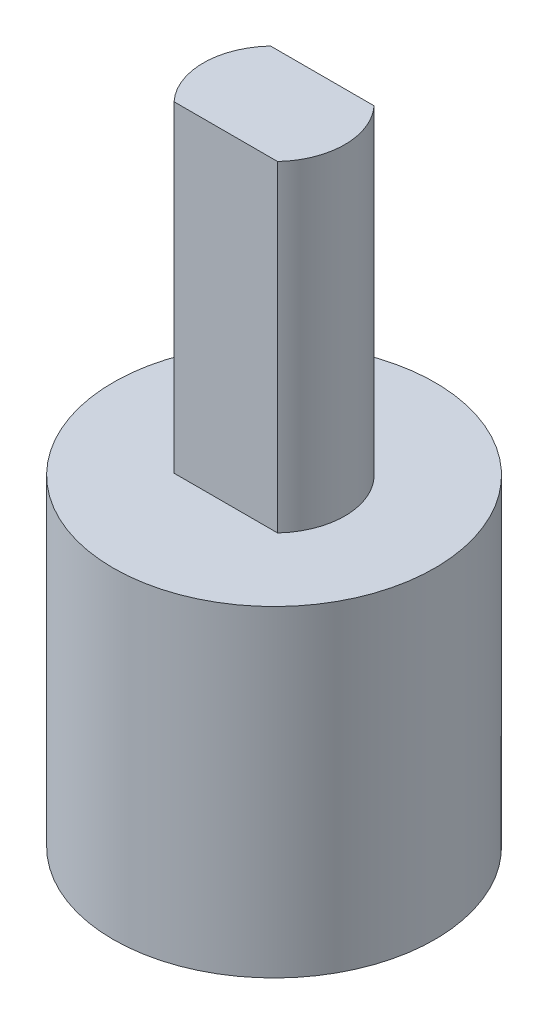
ISO-10303-21;
HEADER;
FILE_DESCRIPTION(('STEP AP214'),'2;1');
FILE_NAME('part.step','',(''),(''),'','','');
FILE_SCHEMA(('AUTOMOTIVE_DESIGN { 1 0 10303 214 1 1 1 1 }'));
ENDSEC;
DATA;
#1=APPLICATION_CONTEXT('core data for automotive mechanical design processes');
#2=APPLICATION_PROTOCOL_DEFINITION('international standard','automotive_design',2000,#1);
#3=PRODUCT_CONTEXT('',#1,'mechanical');
#4=PRODUCT('Part','Part','',(#3));
#5=PRODUCT_RELATED_PRODUCT_CATEGORY('part','',(#4));
#6=PRODUCT_DEFINITION_FORMATION('','',#4);
#7=PRODUCT_DEFINITION_CONTEXT('part definition',#1,'design');
#8=PRODUCT_DEFINITION('design','',#6,#7);
#9=PRODUCT_DEFINITION_SHAPE('','',#8);
#10=(LENGTH_UNIT() NAMED_UNIT(*) SI_UNIT(.MILLI.,.METRE.));
#11=(NAMED_UNIT(*) PLANE_ANGLE_UNIT() SI_UNIT($,.RADIAN.));
#12=(NAMED_UNIT(*) SI_UNIT($,.STERADIAN.) SOLID_ANGLE_UNIT());
#13=UNCERTAINTY_MEASURE_WITH_UNIT(LENGTH_MEASURE(1.E-05),#10,'distance_accuracy_value','');
#14=(GEOMETRIC_REPRESENTATION_CONTEXT(3) GLOBAL_UNCERTAINTY_ASSIGNED_CONTEXT((#13)) GLOBAL_UNIT_ASSIGNED_CONTEXT((#10,
#11,#12)) REPRESENTATION_CONTEXT('',''));
#15=CARTESIAN_POINT('',(0.,0.,0.));
#16=DIRECTION('',(0.,0.,1.));
#17=DIRECTION('',(1.,0.,0.));
#18=AXIS2_PLACEMENT_3D('',#15,#16,#17);
#19=CARTESIAN_POINT('',(0.,0.,0.));
#20=DIRECTION('',(0.,1.,0.));
#21=DIRECTION('',(0.,0.,1.));
#22=AXIS2_PLACEMENT_3D('',#19,#20,#21);
#23=PLANE('',#22);
#24=CARTESIAN_POINT('',(0.,0.,0.));
#25=DIRECTION('',(0.,1.,0.));
#26=DIRECTION('',(0.,0.,1.));
#27=AXIS2_PLACEMENT_3D('',#24,#25,#26);
#28=CIRCLE('',#27,5.);
#29=CARTESIAN_POINT('',(0.,0.,5.));
#30=VERTEX_POINT('',#29);
#31=EDGE_CURVE('E11',#30,#30,#28,.T.);
#32=ORIENTED_EDGE('',*,*,#31,.F.);
#33=EDGE_LOOP('',(#32));
#34=FACE_BOUND('',#33,.T.);
#35=CARTESIAN_POINT('',(0.,0.,0.));
#36=DIRECTION('',(0.,1.,0.));
#37=DIRECTION('',(0.,0.,1.));
#38=AXIS2_PLACEMENT_3D('',#35,#36,#37);
#39=CIRCLE('',#38,2.5);
#40=CARTESIAN_POINT('',(-2.,0.,-1.5));
#41=VERTEX_POINT('',#40);
#42=CARTESIAN_POINT('',(2.,0.,-1.5));
#43=VERTEX_POINT('',#42);
#44=EDGE_CURVE('E113',#41,#43,#39,.T.);
#45=ORIENTED_EDGE('',*,*,#44,.T.);
#46=DIRECTION('',(-1.,0.,0.));
#47=VECTOR('',#46,1.);
#48=CARTESIAN_POINT('',(-2.,0.,-1.5));
#49=LINE('',#48,#47);
#50=EDGE_CURVE('E123',#43,#41,#49,.T.);
#51=ORIENTED_EDGE('',*,*,#50,.T.);
#52=EDGE_LOOP('',(#45,#51));
#53=FACE_BOUND('',#52,.T.);
#54=ADVANCED_FACE('F37',(#34,#53),#23,.F.);
#55=CARTESIAN_POINT('',(0.,8.,0.));
#56=DIRECTION('',(0.,-1.,0.));
#57=DIRECTION('',(0.,0.,-1.));
#58=AXIS2_PLACEMENT_3D('',#55,#56,#57);
#59=CYLINDRICAL_SURFACE('',#58,5.);
#60=ORIENTED_EDGE('',*,*,#31,.T.);
#61=EDGE_LOOP('',(#60));
#62=FACE_BOUND('',#61,.T.);
#63=CARTESIAN_POINT('',(0.,10.,0.));
#64=DIRECTION('',(0.,1.,0.));
#65=DIRECTION('',(0.,0.,1.));
#66=AXIS2_PLACEMENT_3D('',#63,#64,#65);
#67=CIRCLE('',#66,5.);
#68=CARTESIAN_POINT('',(0.,10.,5.));
#69=VERTEX_POINT('',#68);
#70=EDGE_CURVE('E110',#69,#69,#67,.T.);
#71=ORIENTED_EDGE('',*,*,#70,.F.);
#72=EDGE_LOOP('',(#71));
#73=FACE_BOUND('',#72,.T.);
#74=ADVANCED_FACE('F39',(#62,#73),#59,.T.);
#75=CARTESIAN_POINT('',(0.,8.,0.));
#76=DIRECTION('',(0.,-1.,0.));
#77=DIRECTION('',(0.,0.,-1.));
#78=AXIS2_PLACEMENT_3D('',#75,#76,#77);
#79=CYLINDRICAL_SURFACE('',#78,2.5);
#80=ORIENTED_EDGE('',*,*,#44,.F.);
#81=DIRECTION('',(0.,-1.,0.));
#82=VECTOR('',#81,1.);
#83=CARTESIAN_POINT('',(-2.,8.,-1.5));
#84=LINE('',#83,#82);
#85=CARTESIAN_POINT('',(-2.,8.,-1.5));
#86=VERTEX_POINT('',#85);
#87=EDGE_CURVE('E126',#86,#41,#84,.T.);
#88=ORIENTED_EDGE('',*,*,#87,.F.);
#89=CARTESIAN_POINT('',(0.,8.,0.));
#90=DIRECTION('',(0.,1.,0.));
#91=DIRECTION('',(0.,0.,1.));
#92=AXIS2_PLACEMENT_3D('',#89,#90,#91);
#93=CIRCLE('',#92,2.5);
#94=CARTESIAN_POINT('',(2.,8.,-1.5));
#95=VERTEX_POINT('',#94);
#96=EDGE_CURVE('E119',#86,#95,#93,.T.);
#97=ORIENTED_EDGE('',*,*,#96,.T.);
#98=DIRECTION('',(0.,-1.,0.));
#99=VECTOR('',#98,1.);
#100=CARTESIAN_POINT('',(2.,8.,-1.5));
#101=LINE('',#100,#99);
#102=EDGE_CURVE('E45',#95,#43,#101,.T.);
#103=ORIENTED_EDGE('',*,*,#102,.T.);
#104=EDGE_LOOP('',(#80,#88,#97,#103));
#105=FACE_BOUND('',#104,.T.);
#106=ADVANCED_FACE('F135',(#105),#79,.F.);
#107=CARTESIAN_POINT('',(-2.,8.,-1.5));
#108=DIRECTION('',(0.,0.,1.));
#109=DIRECTION('',(1.,0.,0.));
#110=AXIS2_PLACEMENT_3D('',#107,#108,#109);
#111=PLANE('',#110);
#112=ORIENTED_EDGE('',*,*,#50,.F.);
#113=ORIENTED_EDGE('',*,*,#102,.F.);
#114=DIRECTION('',(-1.,0.,0.));
#115=VECTOR('',#114,1.);
#116=CARTESIAN_POINT('',(-2.,8.,-1.5));
#117=LINE('',#116,#115);
#118=EDGE_CURVE('E122',#95,#86,#117,.T.);
#119=ORIENTED_EDGE('',*,*,#118,.T.);
#120=ORIENTED_EDGE('',*,*,#87,.T.);
#121=EDGE_LOOP('',(#112,#113,#119,#120));
#122=FACE_BOUND('',#121,.T.);
#123=ADVANCED_FACE('F139',(#122),#111,.T.);
#124=CARTESIAN_POINT('',(0.,8.,0.));
#125=DIRECTION('',(0.,1.,0.));
#126=DIRECTION('',(0.,0.,1.));
#127=AXIS2_PLACEMENT_3D('',#124,#125,#126);
#128=PLANE('',#127);
#129=ORIENTED_EDGE('',*,*,#118,.F.);
#130=ORIENTED_EDGE('',*,*,#96,.F.);
#131=EDGE_LOOP('',(#129,#130));
#132=FACE_BOUND('',#131,.T.);
#133=ADVANCED_FACE('F141',(#132),#128,.F.);
#134=CARTESIAN_POINT('',(0.,10.,0.));
#135=DIRECTION('',(0.,1.,0.));
#136=DIRECTION('',(0.,0.,1.));
#137=AXIS2_PLACEMENT_3D('',#134,#135,#136);
#138=PLANE('',#137);
#139=CARTESIAN_POINT('',(0.,10.,0.));
#140=DIRECTION('',(0.,1.,0.));
#141=DIRECTION('',(0.,0.,1.));
#142=AXIS2_PLACEMENT_3D('',#139,#140,#141);
#143=CIRCLE('',#142,2.2);
#144=CARTESIAN_POINT('',(-1.60934769394311,10.,-1.5));
#145=VERTEX_POINT('',#144);
#146=CARTESIAN_POINT('',(-1.60934769394311,10.,1.5));
#147=VERTEX_POINT('',#146);
#148=EDGE_CURVE('E52',#145,#147,#143,.T.);
#149=ORIENTED_EDGE('',*,*,#148,.F.);
#150=DIRECTION('',(-1.,0.,0.));
#151=VECTOR('',#150,1.);
#152=CARTESIAN_POINT('',(-1.60934769394311,10.,-1.5));
#153=LINE('',#152,#151);
#154=CARTESIAN_POINT('',(1.60934769394311,10.,-1.5));
#155=VERTEX_POINT('',#154);
#156=EDGE_CURVE('E56',#155,#145,#153,.T.);
#157=ORIENTED_EDGE('',*,*,#156,.F.);
#158=CARTESIAN_POINT('',(0.,10.,0.));
#159=DIRECTION('',(0.,1.,0.));
#160=DIRECTION('',(0.,0.,1.));
#161=AXIS2_PLACEMENT_3D('',#158,#159,#160);
#162=CIRCLE('',#161,2.2);
#163=CARTESIAN_POINT('',(1.60934769394311,10.,1.5));
#164=VERTEX_POINT('',#163);
#165=EDGE_CURVE('E230',#164,#155,#162,.T.);
#166=ORIENTED_EDGE('',*,*,#165,.F.);
#167=DIRECTION('',(1.,0.,0.));
#168=VECTOR('',#167,1.);
#169=CARTESIAN_POINT('',(-1.60934769394311,10.,1.5));
#170=LINE('',#169,#168);
#171=EDGE_CURVE('E236',#147,#164,#170,.T.);
#172=ORIENTED_EDGE('',*,*,#171,.F.);
#173=EDGE_LOOP('',(#149,#157,#166,#172));
#174=FACE_BOUND('',#173,.T.);
#175=ORIENTED_EDGE('',*,*,#70,.T.);
#176=EDGE_LOOP('',(#175));
#177=FACE_BOUND('',#176,.T.);
#178=ADVANCED_FACE('F143',(#174,#177),#138,.T.);
#179=CARTESIAN_POINT('',(0.,20.,0.));
#180=DIRECTION('',(0.,-1.,0.));
#181=DIRECTION('',(0.,0.,-1.));
#182=AXIS2_PLACEMENT_3D('',#179,#180,#181);
#183=CYLINDRICAL_SURFACE('',#182,2.2);
#184=ORIENTED_EDGE('',*,*,#148,.T.);
#185=DIRECTION('',(0.,-1.,0.));
#186=VECTOR('',#185,1.);
#187=CARTESIAN_POINT('',(-1.60934769394311,20.,1.5));
#188=LINE('',#187,#186);
#189=CARTESIAN_POINT('',(-1.60934769394311,20.,1.5));
#190=VERTEX_POINT('',#189);
#191=EDGE_CURVE('E93',#190,#147,#188,.T.);
#192=ORIENTED_EDGE('',*,*,#191,.F.);
#193=CARTESIAN_POINT('',(0.,20.,0.));
#194=DIRECTION('',(0.,1.,0.));
#195=DIRECTION('',(0.,0.,1.));
#196=AXIS2_PLACEMENT_3D('',#193,#194,#195);
#197=CIRCLE('',#196,2.2);
#198=CARTESIAN_POINT('',(-1.60934769394311,20.,-1.5));
#199=VERTEX_POINT('',#198);
#200=EDGE_CURVE('E99',#199,#190,#197,.T.);
#201=ORIENTED_EDGE('',*,*,#200,.F.);
#202=DIRECTION('',(0.,-1.,0.));
#203=VECTOR('',#202,1.);
#204=CARTESIAN_POINT('',(-1.60934769394311,20.,-1.5));
#205=LINE('',#204,#203);
#206=EDGE_CURVE('E228',#199,#145,#205,.T.);
#207=ORIENTED_EDGE('',*,*,#206,.T.);
#208=EDGE_LOOP('',(#184,#192,#201,#207));
#209=FACE_BOUND('',#208,.T.);
#210=ADVANCED_FACE('F109',(#209),#183,.T.);
#211=CARTESIAN_POINT('',(-1.60934769394311,20.,1.5));
#212=DIRECTION('',(0.,0.,-1.));
#213=DIRECTION('',(-1.,0.,0.));
#214=AXIS2_PLACEMENT_3D('',#211,#212,#213);
#215=PLANE('',#214);
#216=ORIENTED_EDGE('',*,*,#171,.T.);
#217=DIRECTION('',(0.,-1.,0.));
#218=VECTOR('',#217,1.);
#219=CARTESIAN_POINT('',(1.60934769394311,20.,1.5));
#220=LINE('',#219,#218);
#221=CARTESIAN_POINT('',(1.60934769394311,20.,1.5));
#222=VERTEX_POINT('',#221);
#223=EDGE_CURVE('E95',#222,#164,#220,.T.);
#224=ORIENTED_EDGE('',*,*,#223,.F.);
#225=DIRECTION('',(1.,0.,0.));
#226=VECTOR('',#225,1.);
#227=CARTESIAN_POINT('',(-1.60934769394311,20.,1.5));
#228=LINE('',#227,#226);
#229=EDGE_CURVE('E88',#190,#222,#228,.T.);
#230=ORIENTED_EDGE('',*,*,#229,.F.);
#231=ORIENTED_EDGE('',*,*,#191,.T.);
#232=EDGE_LOOP('',(#216,#224,#230,#231));
#233=FACE_BOUND('',#232,.T.);
#234=ADVANCED_FACE('F91',(#233),#215,.F.);
#235=CARTESIAN_POINT('',(0.,20.,0.));
#236=DIRECTION('',(0.,-1.,0.));
#237=DIRECTION('',(0.,0.,-1.));
#238=AXIS2_PLACEMENT_3D('',#235,#236,#237);
#239=CYLINDRICAL_SURFACE('',#238,2.2);
#240=ORIENTED_EDGE('',*,*,#165,.T.);
#241=DIRECTION('',(0.,-1.,0.));
#242=VECTOR('',#241,1.);
#243=CARTESIAN_POINT('',(1.60934769394311,20.,-1.5));
#244=LINE('',#243,#242);
#245=CARTESIAN_POINT('',(1.60934769394311,20.,-1.5));
#246=VERTEX_POINT('',#245);
#247=EDGE_CURVE('E115',#246,#155,#244,.T.);
#248=ORIENTED_EDGE('',*,*,#247,.F.);
#249=CARTESIAN_POINT('',(0.,20.,0.));
#250=DIRECTION('',(0.,1.,0.));
#251=DIRECTION('',(0.,0.,1.));
#252=AXIS2_PLACEMENT_3D('',#249,#250,#251);
#253=CIRCLE('',#252,2.2);
#254=EDGE_CURVE('E98',#222,#246,#253,.T.);
#255=ORIENTED_EDGE('',*,*,#254,.F.);
#256=ORIENTED_EDGE('',*,*,#223,.T.);
#257=EDGE_LOOP('',(#240,#248,#255,#256));
#258=FACE_BOUND('',#257,.T.);
#259=ADVANCED_FACE('F196',(#258),#239,.T.);
#260=CARTESIAN_POINT('',(-1.60934769394311,20.,-1.5));
#261=DIRECTION('',(0.,0.,1.));
#262=DIRECTION('',(1.,0.,0.));
#263=AXIS2_PLACEMENT_3D('',#260,#261,#262);
#264=PLANE('',#263);
#265=ORIENTED_EDGE('',*,*,#156,.T.);
#266=ORIENTED_EDGE('',*,*,#206,.F.);
#267=DIRECTION('',(-1.,0.,0.));
#268=VECTOR('',#267,1.);
#269=CARTESIAN_POINT('',(-1.60934769394311,20.,-1.5));
#270=LINE('',#269,#268);
#271=EDGE_CURVE('E104',#246,#199,#270,.T.);
#272=ORIENTED_EDGE('',*,*,#271,.F.);
#273=ORIENTED_EDGE('',*,*,#247,.T.);
#274=EDGE_LOOP('',(#265,#266,#272,#273));
#275=FACE_BOUND('',#274,.T.);
#276=ADVANCED_FACE('F205',(#275),#264,.F.);
#277=CARTESIAN_POINT('',(0.,20.,0.));
#278=DIRECTION('',(0.,1.,0.));
#279=DIRECTION('',(0.,0.,1.));
#280=AXIS2_PLACEMENT_3D('',#277,#278,#279);
#281=PLANE('',#280);
#282=ORIENTED_EDGE('',*,*,#200,.T.);
#283=ORIENTED_EDGE('',*,*,#229,.T.);
#284=ORIENTED_EDGE('',*,*,#254,.T.);
#285=ORIENTED_EDGE('',*,*,#271,.T.);
#286=EDGE_LOOP('',(#282,#283,#284,#285));
#287=FACE_BOUND('',#286,.T.);
#288=ADVANCED_FACE('F102',(#287),#281,.T.);
#289=CLOSED_SHELL('',(#54,#74,#106,#123,#133,#178,#210,#234,#259,#276,#288));
#290=MANIFOLD_SOLID_BREP('B2',#289);
#291=ADVANCED_BREP_SHAPE_REPRESENTATION('',(#18,#290),#14);
#292=SHAPE_DEFINITION_REPRESENTATION(#9,#291);
ENDSEC;
END-ISO-10303-21;
